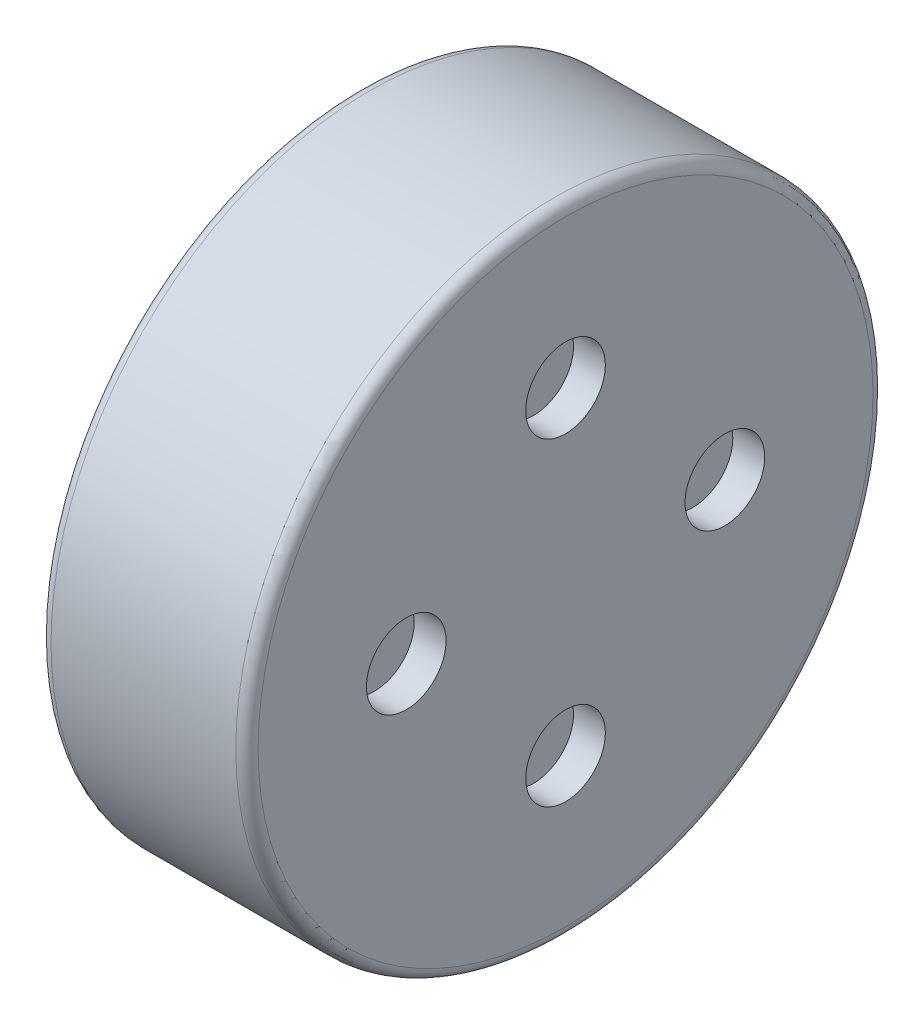
ISO-10303-21;
HEADER;
FILE_DESCRIPTION(('STEP AP214'),'2;1');
FILE_NAME('part.step','',(''),(''),'','','');
FILE_SCHEMA(('AUTOMOTIVE_DESIGN { 1 0 10303 214 1 1 1 1 }'));
ENDSEC;
DATA;
#1=APPLICATION_CONTEXT('core data for automotive mechanical design processes');
#2=APPLICATION_PROTOCOL_DEFINITION('international standard','automotive_design',2000,#1);
#3=PRODUCT_CONTEXT('',#1,'mechanical');
#4=PRODUCT('Part','Part','',(#3));
#5=PRODUCT_RELATED_PRODUCT_CATEGORY('part','',(#4));
#6=PRODUCT_DEFINITION_FORMATION('','',#4);
#7=PRODUCT_DEFINITION_CONTEXT('part definition',#1,'design');
#8=PRODUCT_DEFINITION('design','',#6,#7);
#9=PRODUCT_DEFINITION_SHAPE('','',#8);
#10=(LENGTH_UNIT() NAMED_UNIT(*) SI_UNIT(.MILLI.,.METRE.));
#11=(NAMED_UNIT(*) PLANE_ANGLE_UNIT() SI_UNIT($,.RADIAN.));
#12=(NAMED_UNIT(*) SI_UNIT($,.STERADIAN.) SOLID_ANGLE_UNIT());
#13=UNCERTAINTY_MEASURE_WITH_UNIT(LENGTH_MEASURE(1.E-05),#10,'distance_accuracy_value','');
#14=(GEOMETRIC_REPRESENTATION_CONTEXT(3) GLOBAL_UNCERTAINTY_ASSIGNED_CONTEXT((#13)) GLOBAL_UNIT_ASSIGNED_CONTEXT((#10,
#11,#12)) REPRESENTATION_CONTEXT('',''));
#15=CARTESIAN_POINT('',(0.,0.,0.));
#16=DIRECTION('',(0.,0.,1.));
#17=DIRECTION('',(1.,0.,0.));
#18=AXIS2_PLACEMENT_3D('',#15,#16,#17);
#19=CARTESIAN_POINT('',(1.3,0.,0.));
#20=DIRECTION('',(-1.,0.,0.));
#21=DIRECTION('',(0.,0.,1.));
#22=AXIS2_PLACEMENT_3D('',#19,#20,#21);
#23=CYLINDRICAL_SURFACE('',#22,2.);
#24=CARTESIAN_POINT('',(0.07,0.,0.));
#25=DIRECTION('',(-1.,0.,0.));
#26=DIRECTION('',(0.,0.,1.));
#27=AXIS2_PLACEMENT_3D('',#24,#25,#26);
#28=CIRCLE('',#27,2.);
#29=CARTESIAN_POINT('',(0.07,0.,2.));
#30=VERTEX_POINT('',#29);
#31=EDGE_CURVE('E60',#30,#30,#28,.F.);
#32=ORIENTED_EDGE('',*,*,#31,.T.);
#33=EDGE_LOOP('',(#32));
#34=FACE_BOUND('',#33,.T.);
#35=CARTESIAN_POINT('',(1.23,0.,0.));
#36=DIRECTION('',(1.,0.,0.));
#37=DIRECTION('',(0.,0.,-1.));
#38=AXIS2_PLACEMENT_3D('',#35,#36,#37);
#39=CIRCLE('',#38,2.);
#40=CARTESIAN_POINT('',(1.23,0.,-2.));
#41=VERTEX_POINT('',#40);
#42=EDGE_CURVE('E63',#41,#41,#39,.F.);
#43=ORIENTED_EDGE('',*,*,#42,.T.);
#44=EDGE_LOOP('',(#43));
#45=FACE_BOUND('',#44,.T.);
#46=ADVANCED_FACE('F31',(#34,#45),#23,.T.);
#47=CARTESIAN_POINT('',(1.3,2.,0.));
#48=DIRECTION('',(1.,0.,0.));
#49=DIRECTION('',(0.,0.,-1.));
#50=AXIS2_PLACEMENT_3D('',#47,#48,#49);
#51=PLANE('',#50);
#52=CARTESIAN_POINT('',(1.3,0.,0.));
#53=DIRECTION('',(1.,0.,0.));
#54=DIRECTION('',(0.,0.,-1.));
#55=AXIS2_PLACEMENT_3D('',#52,#53,#54);
#56=CIRCLE('',#55,1.93);
#57=CARTESIAN_POINT('',(1.3,0.,-1.93));
#58=VERTEX_POINT('',#57);
#59=EDGE_CURVE('E57',#58,#58,#56,.T.);
#60=ORIENTED_EDGE('',*,*,#59,.T.);
#61=EDGE_LOOP('',(#60));
#62=FACE_BOUND('',#61,.T.);
#63=CARTESIAN_POINT('',(1.3,0.,1.));
#64=DIRECTION('',(1.,0.,0.));
#65=DIRECTION('',(0.,0.,-1.));
#66=AXIS2_PLACEMENT_3D('',#63,#64,#65);
#67=CIRCLE('',#66,0.250000000000014);
#68=CARTESIAN_POINT('',(1.3,0.,0.749999999999986));
#69=VERTEX_POINT('',#68);
#70=EDGE_CURVE('E147',#69,#69,#67,.T.);
#71=ORIENTED_EDGE('',*,*,#70,.F.);
#72=EDGE_LOOP('',(#71));
#73=FACE_BOUND('',#72,.T.);
#74=CARTESIAN_POINT('',(1.3,-1.,0.));
#75=DIRECTION('',(1.,0.,0.));
#76=DIRECTION('',(0.,0.,-1.));
#77=AXIS2_PLACEMENT_3D('',#74,#75,#76);
#78=CIRCLE('',#77,0.250000000000014);
#79=CARTESIAN_POINT('',(1.3,-1.,-0.250000000000014));
#80=VERTEX_POINT('',#79);
#81=EDGE_CURVE('E141',#80,#80,#78,.T.);
#82=ORIENTED_EDGE('',*,*,#81,.F.);
#83=EDGE_LOOP('',(#82));
#84=FACE_BOUND('',#83,.T.);
#85=CARTESIAN_POINT('',(1.3,0.,-1.));
#86=DIRECTION('',(1.,0.,0.));
#87=DIRECTION('',(0.,0.,-1.));
#88=AXIS2_PLACEMENT_3D('',#85,#86,#87);
#89=CIRCLE('',#88,0.250000000000014);
#90=CARTESIAN_POINT('',(1.3,0.,-1.25000000000001));
#91=VERTEX_POINT('',#90);
#92=EDGE_CURVE('E135',#91,#91,#89,.T.);
#93=ORIENTED_EDGE('',*,*,#92,.F.);
#94=EDGE_LOOP('',(#93));
#95=FACE_BOUND('',#94,.T.);
#96=CARTESIAN_POINT('',(1.3,1.,0.));
#97=DIRECTION('',(1.,0.,0.));
#98=DIRECTION('',(0.,0.,-1.));
#99=AXIS2_PLACEMENT_3D('',#96,#97,#98);
#100=CIRCLE('',#99,0.250000000000014);
#101=CARTESIAN_POINT('',(1.3,1.,-0.250000000000014));
#102=VERTEX_POINT('',#101);
#103=EDGE_CURVE('E129',#102,#102,#100,.T.);
#104=ORIENTED_EDGE('',*,*,#103,.F.);
#105=EDGE_LOOP('',(#104));
#106=FACE_BOUND('',#105,.T.);
#107=ADVANCED_FACE('F153',(#62,#73,#84,#95,#106),#51,.T.);
#108=CARTESIAN_POINT('',(0.03,0.,0.));
#109=DIRECTION('',(-1.,0.,0.));
#110=DIRECTION('',(0.,0.,1.));
#111=AXIS2_PLACEMENT_3D('',#108,#109,#110);
#112=PLANE('',#111);
#113=CARTESIAN_POINT('',(0.03,-1.093714993739,-0.3553695435312));
#114=DIRECTION('',(-1.,0.,0.));
#115=DIRECTION('',(0.,0.,1.));
#116=AXIS2_PLACEMENT_3D('',#113,#114,#115);
#117=CIRCLE('',#116,0.1999999999996);
#118=CARTESIAN_POINT('',(0.03,-1.093714993739,-0.1553695435316));
#119=VERTEX_POINT('',#118);
#120=EDGE_CURVE('E87',#119,#119,#117,.T.);
#121=ORIENTED_EDGE('',*,*,#120,.F.);
#122=EDGE_LOOP('',(#121));
#123=FACE_BOUND('',#122,.T.);
#124=CARTESIAN_POINT('',(0.03,-0.6759530401363,0.9303695435312));
#125=DIRECTION('',(-1.,0.,0.));
#126=DIRECTION('',(0.,0.,1.));
#127=AXIS2_PLACEMENT_3D('',#124,#125,#126);
#128=CIRCLE('',#127,0.2);
#129=CARTESIAN_POINT('',(0.03,-0.6759530401363,1.1303695435312));
#130=VERTEX_POINT('',#129);
#131=EDGE_CURVE('E90',#130,#130,#128,.T.);
#132=ORIENTED_EDGE('',*,*,#131,.F.);
#133=EDGE_LOOP('',(#132));
#134=FACE_BOUND('',#133,.T.);
#135=CARTESIAN_POINT('',(0.03,0.6759530401363,0.9303695435312));
#136=DIRECTION('',(-1.,0.,0.));
#137=DIRECTION('',(0.,0.,1.));
#138=AXIS2_PLACEMENT_3D('',#135,#136,#137);
#139=CIRCLE('',#138,0.2);
#140=CARTESIAN_POINT('',(0.03,0.6759530401363,1.1303695435312));
#141=VERTEX_POINT('',#140);
#142=EDGE_CURVE('E93',#141,#141,#139,.T.);
#143=ORIENTED_EDGE('',*,*,#142,.F.);
#144=EDGE_LOOP('',(#143));
#145=FACE_BOUND('',#144,.T.);
#146=CARTESIAN_POINT('',(0.03,1.093714993739,-0.3553695435312));
#147=DIRECTION('',(-1.,0.,0.));
#148=DIRECTION('',(0.,0.,1.));
#149=AXIS2_PLACEMENT_3D('',#146,#147,#148);
#150=CIRCLE('',#149,0.2);
#151=CARTESIAN_POINT('',(0.03,1.093714993739,-0.1553695435312));
#152=VERTEX_POINT('',#151);
#153=EDGE_CURVE('E96',#152,#152,#150,.T.);
#154=ORIENTED_EDGE('',*,*,#153,.F.);
#155=EDGE_LOOP('',(#154));
#156=FACE_BOUND('',#155,.T.);
#157=CARTESIAN_POINT('',(0.03,0.,-1.15));
#158=DIRECTION('',(-1.,0.,0.));
#159=DIRECTION('',(0.,0.,1.));
#160=AXIS2_PLACEMENT_3D('',#157,#158,#159);
#161=CIRCLE('',#160,0.2);
#162=CARTESIAN_POINT('',(0.03,0.,-0.95));
#163=VERTEX_POINT('',#162);
#164=EDGE_CURVE('E99',#163,#163,#161,.T.);
#165=ORIENTED_EDGE('',*,*,#164,.F.);
#166=EDGE_LOOP('',(#165));
#167=FACE_BOUND('',#166,.T.);
#168=CARTESIAN_POINT('',(0.03,0.,0.));
#169=DIRECTION('',(-1.,0.,0.));
#170=DIRECTION('',(0.,0.,-1.));
#171=AXIS2_PLACEMENT_3D('',#168,#169,#170);
#172=CIRCLE('',#171,0.9);
#173=CARTESIAN_POINT('',(0.03,0.,-0.9));
#174=VERTEX_POINT('',#173);
#175=EDGE_CURVE('E116',#174,#174,#172,.T.);
#176=ORIENTED_EDGE('',*,*,#175,.F.);
#177=EDGE_LOOP('',(#176));
#178=FACE_BOUND('',#177,.T.);
#179=CARTESIAN_POINT('',(0.0300000000000001,0.,0.));
#180=DIRECTION('',(-1.,0.,0.));
#181=DIRECTION('',(0.,0.,1.));
#182=AXIS2_PLACEMENT_3D('',#179,#180,#181);
#183=CIRCLE('',#182,1.8);
#184=CARTESIAN_POINT('',(0.0300000000000001,0.,1.8));
#185=VERTEX_POINT('',#184);
#186=EDGE_CURVE('E106',#185,#185,#183,.T.);
#187=ORIENTED_EDGE('',*,*,#186,.T.);
#188=EDGE_LOOP('',(#187));
#189=FACE_BOUND('',#188,.T.);
#190=ADVANCED_FACE('F156',(#123,#134,#145,#156,#167,#178,#189),#112,.T.);
#191=CARTESIAN_POINT('',(1.3,0.,0.));
#192=DIRECTION('',(-1.,0.,0.));
#193=DIRECTION('',(0.,0.,1.));
#194=AXIS2_PLACEMENT_3D('',#191,#192,#193);
#195=CYLINDRICAL_SURFACE('',#194,1.8);
#196=CARTESIAN_POINT('',(0.049999999999999,0.,0.));
#197=DIRECTION('',(-1.,0.,0.));
#198=DIRECTION('',(0.,0.,1.));
#199=AXIS2_PLACEMENT_3D('',#196,#197,#198);
#200=CIRCLE('',#199,1.8);
#201=CARTESIAN_POINT('',(0.049999999999999,0.,1.8));
#202=VERTEX_POINT('',#201);
#203=EDGE_CURVE('E109',#202,#202,#200,.T.);
#204=ORIENTED_EDGE('',*,*,#203,.T.);
#205=EDGE_LOOP('',(#204));
#206=FACE_BOUND('',#205,.T.);
#207=ORIENTED_EDGE('',*,*,#186,.F.);
#208=EDGE_LOOP('',(#207));
#209=FACE_BOUND('',#208,.T.);
#210=ADVANCED_FACE('F294',(#206,#209),#195,.T.);
#211=CARTESIAN_POINT('',(0.0499999999999991,0.,0.));
#212=DIRECTION('',(-1.,0.,0.));
#213=DIRECTION('',(0.,0.,1.));
#214=AXIS2_PLACEMENT_3D('',#211,#212,#213);
#215=TOROIDAL_SURFACE('',#214,1.85,0.0499999999999993);
#216=CARTESIAN_POINT('',(0.,0.,0.));
#217=DIRECTION('',(-1.,0.,0.));
#218=DIRECTION('',(0.,0.,1.));
#219=AXIS2_PLACEMENT_3D('',#216,#217,#218);
#220=CIRCLE('',#219,1.85);
#221=CARTESIAN_POINT('',(0.,0.,1.85));
#222=VERTEX_POINT('',#221);
#223=EDGE_CURVE('E112',#222,#222,#220,.T.);
#224=ORIENTED_EDGE('',*,*,#223,.T.);
#225=EDGE_LOOP('',(#224));
#226=FACE_BOUND('',#225,.T.);
#227=ORIENTED_EDGE('',*,*,#203,.F.);
#228=EDGE_LOOP('',(#227));
#229=FACE_BOUND('',#228,.T.);
#230=ADVANCED_FACE('F290',(#226,#229),#215,.T.);
#231=CARTESIAN_POINT('',(0.,1.85,0.));
#232=DIRECTION('',(-1.,0.,0.));
#233=DIRECTION('',(0.,0.,1.));
#234=AXIS2_PLACEMENT_3D('',#231,#232,#233);
#235=PLANE('',#234);
#236=CARTESIAN_POINT('',(0.,0.,0.));
#237=DIRECTION('',(-1.,0.,0.));
#238=DIRECTION('',(0.,0.,1.));
#239=AXIS2_PLACEMENT_3D('',#236,#237,#238);
#240=CIRCLE('',#239,1.93);
#241=CARTESIAN_POINT('',(0.,0.,1.93));
#242=VERTEX_POINT('',#241);
#243=EDGE_CURVE('E66',#242,#242,#240,.T.);
#244=ORIENTED_EDGE('',*,*,#243,.T.);
#245=EDGE_LOOP('',(#244));
#246=FACE_BOUND('',#245,.T.);
#247=ORIENTED_EDGE('',*,*,#223,.F.);
#248=EDGE_LOOP('',(#247));
#249=FACE_BOUND('',#248,.T.);
#250=ADVANCED_FACE('F286',(#246,#249),#235,.T.);
#251=CARTESIAN_POINT('',(0.08,0.,0.));
#252=DIRECTION('',(-1.,0.,0.));
#253=DIRECTION('',(0.,0.,1.));
#254=AXIS2_PLACEMENT_3D('',#251,#252,#253);
#255=CYLINDRICAL_SURFACE('',#254,0.9);
#256=CARTESIAN_POINT('',(0.08,0.,0.));
#257=DIRECTION('',(-1.,0.,0.));
#258=DIRECTION('',(0.,0.,-1.));
#259=AXIS2_PLACEMENT_3D('',#256,#257,#258);
#260=CIRCLE('',#259,0.9);
#261=CARTESIAN_POINT('',(0.08,0.,-0.9));
#262=VERTEX_POINT('',#261);
#263=EDGE_CURVE('E115',#262,#262,#260,.T.);
#264=ORIENTED_EDGE('',*,*,#263,.F.);
#265=EDGE_LOOP('',(#264));
#266=FACE_BOUND('',#265,.T.);
#267=ORIENTED_EDGE('',*,*,#175,.T.);
#268=EDGE_LOOP('',(#267));
#269=FACE_BOUND('',#268,.T.);
#270=ADVANCED_FACE('F282',(#266,#269),#255,.F.);
#271=CARTESIAN_POINT('',(0.08,0.,0.));
#272=DIRECTION('',(1.,0.,0.));
#273=DIRECTION('',(0.,0.,-1.));
#274=AXIS2_PLACEMENT_3D('',#271,#272,#273);
#275=PLANE('',#274);
#276=CARTESIAN_POINT('',(0.08,0.,0.));
#277=DIRECTION('',(1.,0.,0.));
#278=DIRECTION('',(0.,0.,-1.));
#279=AXIS2_PLACEMENT_3D('',#276,#277,#278);
#280=CIRCLE('',#279,0.6);
#281=CARTESIAN_POINT('',(0.08,0.,-0.6));
#282=VERTEX_POINT('',#281);
#283=EDGE_CURVE('E103',#282,#282,#280,.F.);
#284=ORIENTED_EDGE('',*,*,#283,.F.);
#285=EDGE_LOOP('',(#284));
#286=FACE_BOUND('',#285,.T.);
#287=ORIENTED_EDGE('',*,*,#263,.T.);
#288=EDGE_LOOP('',(#287));
#289=FACE_BOUND('',#288,.T.);
#290=ADVANCED_FACE('F278',(#286,#289),#275,.F.);
#291=CARTESIAN_POINT('',(0.03,0.,0.));
#292=DIRECTION('',(1.,0.,0.));
#293=DIRECTION('',(0.,0.,-1.));
#294=AXIS2_PLACEMENT_3D('',#291,#292,#293);
#295=CYLINDRICAL_SURFACE('',#294,0.6);
#296=CARTESIAN_POINT('',(0.03,0.,0.));
#297=DIRECTION('',(-1.,0.,0.));
#298=DIRECTION('',(0.,0.,1.));
#299=AXIS2_PLACEMENT_3D('',#296,#297,#298);
#300=CIRCLE('',#299,0.6);
#301=CARTESIAN_POINT('',(0.03,0.,0.6));
#302=VERTEX_POINT('',#301);
#303=EDGE_CURVE('E119',#302,#302,#300,.T.);
#304=ORIENTED_EDGE('',*,*,#303,.F.);
#305=EDGE_LOOP('',(#304));
#306=FACE_BOUND('',#305,.T.);
#307=ORIENTED_EDGE('',*,*,#283,.T.);
#308=EDGE_LOOP('',(#307));
#309=FACE_BOUND('',#308,.T.);
#310=ADVANCED_FACE('F274',(#306,#309),#295,.T.);
#311=CARTESIAN_POINT('',(0.03,0.,0.));
#312=DIRECTION('',(-1.,0.,0.));
#313=DIRECTION('',(0.,0.,1.));
#314=AXIS2_PLACEMENT_3D('',#311,#312,#313);
#315=PLANE('',#314);
#316=CARTESIAN_POINT('',(0.03,0.,0.));
#317=DIRECTION('',(-1.,0.,0.));
#318=DIRECTION('',(0.,0.,1.));
#319=AXIS2_PLACEMENT_3D('',#316,#317,#318);
#320=CIRCLE('',#319,0.275);
#321=CARTESIAN_POINT('',(0.03,0.,0.275));
#322=VERTEX_POINT('',#321);
#323=EDGE_CURVE('E102',#322,#322,#320,.T.);
#324=ORIENTED_EDGE('',*,*,#323,.F.);
#325=EDGE_LOOP('',(#324));
#326=FACE_BOUND('',#325,.T.);
#327=ORIENTED_EDGE('',*,*,#303,.T.);
#328=EDGE_LOOP('',(#327));
#329=FACE_BOUND('',#328,.T.);
#330=ADVANCED_FACE('F270',(#326,#329),#315,.T.);
#331=CARTESIAN_POINT('',(-0.05,0.,0.));
#332=DIRECTION('',(1.,0.,0.));
#333=DIRECTION('',(0.,0.,-1.));
#334=AXIS2_PLACEMENT_3D('',#331,#332,#333);
#335=CYLINDRICAL_SURFACE('',#334,0.275);
#336=CARTESIAN_POINT('',(0.0200000000000001,0.,0.));
#337=DIRECTION('',(-1.,0.,0.));
#338=DIRECTION('',(0.,0.,1.));
#339=AXIS2_PLACEMENT_3D('',#336,#337,#338);
#340=CIRCLE('',#339,0.275);
#341=CARTESIAN_POINT('',(0.0200000000000001,0.,0.275));
#342=VERTEX_POINT('',#341);
#343=EDGE_CURVE('E51',#342,#342,#340,.F.);
#344=ORIENTED_EDGE('',*,*,#343,.T.);
#345=EDGE_LOOP('',(#344));
#346=FACE_BOUND('',#345,.T.);
#347=ORIENTED_EDGE('',*,*,#323,.T.);
#348=EDGE_LOOP('',(#347));
#349=FACE_BOUND('',#348,.T.);
#350=ADVANCED_FACE('F266',(#346,#349),#335,.T.);
#351=CARTESIAN_POINT('',(-0.05,0.,0.));
#352=DIRECTION('',(-1.,0.,0.));
#353=DIRECTION('',(0.,0.,1.));
#354=AXIS2_PLACEMENT_3D('',#351,#352,#353);
#355=PLANE('',#354);
#356=CARTESIAN_POINT('',(-0.05,0.,0.));
#357=DIRECTION('',(-1.,0.,0.));
#358=DIRECTION('',(0.,0.,1.));
#359=AXIS2_PLACEMENT_3D('',#356,#357,#358);
#360=CIRCLE('',#359,0.205);
#361=CARTESIAN_POINT('',(-0.05,0.,0.205));
#362=VERTEX_POINT('',#361);
#363=EDGE_CURVE('E54',#362,#362,#360,.T.);
#364=ORIENTED_EDGE('',*,*,#363,.T.);
#365=EDGE_LOOP('',(#364));
#366=FACE_BOUND('',#365,.T.);
#367=ADVANCED_FACE('F262',(#366),#355,.T.);
#368=CARTESIAN_POINT('',(0.03,0.,-1.15));
#369=DIRECTION('',(-1.,0.,0.));
#370=DIRECTION('',(0.,0.,1.));
#371=AXIS2_PLACEMENT_3D('',#368,#369,#370);
#372=CYLINDRICAL_SURFACE('',#371,0.2);
#373=CARTESIAN_POINT('',(0.02,0.,-1.15));
#374=DIRECTION('',(-1.,0.,0.));
#375=DIRECTION('',(0.,0.,1.));
#376=AXIS2_PLACEMENT_3D('',#373,#374,#375);
#377=CIRCLE('',#376,0.2);
#378=CARTESIAN_POINT('',(0.02,0.,-0.95));
#379=VERTEX_POINT('',#378);
#380=EDGE_CURVE('E81',#379,#379,#377,.F.);
#381=ORIENTED_EDGE('',*,*,#380,.T.);
#382=EDGE_LOOP('',(#381));
#383=FACE_BOUND('',#382,.T.);
#384=ORIENTED_EDGE('',*,*,#164,.T.);
#385=EDGE_LOOP('',(#384));
#386=FACE_BOUND('',#385,.T.);
#387=ADVANCED_FACE('F258',(#383,#386),#372,.T.);
#388=CARTESIAN_POINT('',(-0.05,0.,-1.15));
#389=DIRECTION('',(-1.,0.,0.));
#390=DIRECTION('',(0.,0.,1.));
#391=AXIS2_PLACEMENT_3D('',#388,#389,#390);
#392=PLANE('',#391);
#393=CARTESIAN_POINT('',(-0.05,0.,-1.15));
#394=DIRECTION('',(-1.,0.,0.));
#395=DIRECTION('',(0.,0.,1.));
#396=AXIS2_PLACEMENT_3D('',#393,#394,#395);
#397=CIRCLE('',#396,0.13);
#398=CARTESIAN_POINT('',(-0.05,0.,-1.02));
#399=VERTEX_POINT('',#398);
#400=EDGE_CURVE('E84',#399,#399,#397,.T.);
#401=ORIENTED_EDGE('',*,*,#400,.T.);
#402=EDGE_LOOP('',(#401));
#403=FACE_BOUND('',#402,.T.);
#404=ADVANCED_FACE('F254',(#403),#392,.T.);
#405=CARTESIAN_POINT('',(0.03,1.093714993739,-0.3553695435312));
#406=DIRECTION('',(-1.,0.,0.));
#407=DIRECTION('',(0.,-1.,0.));
#408=AXIS2_PLACEMENT_3D('',#405,#406,#407);
#409=CYLINDRICAL_SURFACE('',#408,0.2);
#410=CARTESIAN_POINT('',(0.0200000000000003,1.093714993739,-0.3553695435312));
#411=DIRECTION('',(-1.,0.,0.));
#412=DIRECTION('',(0.,-1.,0.));
#413=AXIS2_PLACEMENT_3D('',#410,#411,#412);
#414=CIRCLE('',#413,0.2);
#415=CARTESIAN_POINT('',(0.0200000000000008,0.893714993739,-0.3553695435312));
#416=VERTEX_POINT('',#415);
#417=EDGE_CURVE('E75',#416,#416,#414,.F.);
#418=ORIENTED_EDGE('',*,*,#417,.T.);
#419=EDGE_LOOP('',(#418));
#420=FACE_BOUND('',#419,.T.);
#421=ORIENTED_EDGE('',*,*,#153,.T.);
#422=EDGE_LOOP('',(#421));
#423=FACE_BOUND('',#422,.T.);
#424=ADVANCED_FACE('F250',(#420,#423),#409,.T.);
#425=CARTESIAN_POINT('',(-0.0499999999999997,1.093714993739,-0.3553695435312));
#426=DIRECTION('',(-1.,0.,0.));
#427=DIRECTION('',(0.,-1.,0.));
#428=AXIS2_PLACEMENT_3D('',#425,#426,#427);
#429=PLANE('',#428);
#430=CARTESIAN_POINT('',(-0.0499999999999997,1.093714993739,-0.3553695435312));
#431=DIRECTION('',(-1.,0.,0.));
#432=DIRECTION('',(0.,-1.,0.));
#433=AXIS2_PLACEMENT_3D('',#430,#431,#432);
#434=CIRCLE('',#433,0.13);
#435=CARTESIAN_POINT('',(-0.0499999999999994,0.963714993739,-0.3553695435312));
#436=VERTEX_POINT('',#435);
#437=EDGE_CURVE('E78',#436,#436,#434,.T.);
#438=ORIENTED_EDGE('',*,*,#437,.T.);
#439=EDGE_LOOP('',(#438));
#440=FACE_BOUND('',#439,.T.);
#441=ADVANCED_FACE('F246',(#440),#429,.T.);
#442=CARTESIAN_POINT('',(0.03,0.6759530401363,0.9303695435312));
#443=DIRECTION('',(-1.,0.,0.));
#444=DIRECTION('',(0.,0.,1.));
#445=AXIS2_PLACEMENT_3D('',#442,#443,#444);
#446=CYLINDRICAL_SURFACE('',#445,0.2);
#447=CARTESIAN_POINT('',(0.02,0.6759530401363,0.9303695435312));
#448=DIRECTION('',(-1.,0.,0.));
#449=DIRECTION('',(0.,0.,1.));
#450=AXIS2_PLACEMENT_3D('',#447,#448,#449);
#451=CIRCLE('',#450,0.2);
#452=CARTESIAN_POINT('',(0.02,0.6759530401363,1.1303695435312));
#453=VERTEX_POINT('',#452);
#454=EDGE_CURVE('E69',#453,#453,#451,.F.);
#455=ORIENTED_EDGE('',*,*,#454,.T.);
#456=EDGE_LOOP('',(#455));
#457=FACE_BOUND('',#456,.T.);
#458=ORIENTED_EDGE('',*,*,#142,.T.);
#459=EDGE_LOOP('',(#458));
#460=FACE_BOUND('',#459,.T.);
#461=ADVANCED_FACE('F242',(#457,#460),#446,.T.);
#462=CARTESIAN_POINT('',(-0.05,0.6759530401363,0.9303695435312));
#463=DIRECTION('',(-1.,0.,0.));
#464=DIRECTION('',(0.,0.,1.));
#465=AXIS2_PLACEMENT_3D('',#462,#463,#464);
#466=PLANE('',#465);
#467=CARTESIAN_POINT('',(-0.05,0.6759530401363,0.9303695435312));
#468=DIRECTION('',(-1.,0.,0.));
#469=DIRECTION('',(0.,0.,1.));
#470=AXIS2_PLACEMENT_3D('',#467,#468,#469);
#471=CIRCLE('',#470,0.13);
#472=CARTESIAN_POINT('',(-0.05,0.6759530401363,1.0603695435312));
#473=VERTEX_POINT('',#472);
#474=EDGE_CURVE('E72',#473,#473,#471,.T.);
#475=ORIENTED_EDGE('',*,*,#474,.T.);
#476=EDGE_LOOP('',(#475));
#477=FACE_BOUND('',#476,.T.);
#478=ADVANCED_FACE('F239',(#477),#466,.T.);
#479=CARTESIAN_POINT('',(0.03,-0.6759530401363,0.9303695435312));
#480=DIRECTION('',(-1.,0.,0.));
#481=DIRECTION('',(0.,-1.,0.));
#482=AXIS2_PLACEMENT_3D('',#479,#480,#481);
#483=CYLINDRICAL_SURFACE('',#482,0.2);
#484=CARTESIAN_POINT('',(0.0200000000000003,-0.6759530401363,0.9303695435312));
#485=DIRECTION('',(-1.,0.,0.));
#486=DIRECTION('',(0.,-1.,0.));
#487=AXIS2_PLACEMENT_3D('',#484,#485,#486);
#488=CIRCLE('',#487,0.2);
#489=CARTESIAN_POINT('',(0.0200000000000008,-0.8759530401363,0.9303695435312));
#490=VERTEX_POINT('',#489);
#491=EDGE_CURVE('E10',#490,#490,#488,.F.);
#492=ORIENTED_EDGE('',*,*,#491,.T.);
#493=EDGE_LOOP('',(#492));
#494=FACE_BOUND('',#493,.T.);
#495=ORIENTED_EDGE('',*,*,#131,.T.);
#496=EDGE_LOOP('',(#495));
#497=FACE_BOUND('',#496,.T.);
#498=ADVANCED_FACE('F236',(#494,#497),#483,.T.);
#499=CARTESIAN_POINT('',(-0.0499999999999997,-0.6759530401363,0.9303695435312));
#500=DIRECTION('',(-1.,0.,0.));
#501=DIRECTION('',(0.,-1.,0.));
#502=AXIS2_PLACEMENT_3D('',#499,#500,#501);
#503=PLANE('',#502);
#504=CARTESIAN_POINT('',(-0.0499999999999997,-0.6759530401363,0.9303695435312));
#505=DIRECTION('',(-1.,0.,0.));
#506=DIRECTION('',(0.,-1.,0.));
#507=AXIS2_PLACEMENT_3D('',#504,#505,#506);
#508=CIRCLE('',#507,0.13);
#509=CARTESIAN_POINT('',(-0.0499999999999994,-0.8059530401363,0.9303695435312));
#510=VERTEX_POINT('',#509);
#511=EDGE_CURVE('E38',#510,#510,#508,.T.);
#512=ORIENTED_EDGE('',*,*,#511,.T.);
#513=EDGE_LOOP('',(#512));
#514=FACE_BOUND('',#513,.T.);
#515=ADVANCED_FACE('F230',(#514),#503,.T.);
#516=CARTESIAN_POINT('',(0.03,-1.093714993739,-0.3553695435312));
#517=DIRECTION('',(-1.,0.,0.));
#518=DIRECTION('',(0.,-1.,0.));
#519=AXIS2_PLACEMENT_3D('',#516,#517,#518);
#520=CYLINDRICAL_SURFACE('',#519,0.1999999999996);
#521=CARTESIAN_POINT('',(0.0199999999999998,-1.093714993739,-0.3553695435312));
#522=DIRECTION('',(-1.,0.,0.));
#523=DIRECTION('',(0.,-1.,0.));
#524=AXIS2_PLACEMENT_3D('',#521,#522,#523);
#525=CIRCLE('',#524,0.1999999999996);
#526=CARTESIAN_POINT('',(0.0199999999999992,-1.2937149937386,-0.3553695435312));
#527=VERTEX_POINT('',#526);
#528=EDGE_CURVE('E42',#527,#527,#525,.F.);
#529=ORIENTED_EDGE('',*,*,#528,.T.);
#530=EDGE_LOOP('',(#529));
#531=FACE_BOUND('',#530,.T.);
#532=ORIENTED_EDGE('',*,*,#120,.T.);
#533=EDGE_LOOP('',(#532));
#534=FACE_BOUND('',#533,.T.);
#535=ADVANCED_FACE('F225',(#531,#534),#520,.T.);
#536=CARTESIAN_POINT('',(-0.0500000000000003,-1.093714993739,-0.3553695435312));
#537=DIRECTION('',(-1.,0.,0.));
#538=DIRECTION('',(0.,-1.,0.));
#539=AXIS2_PLACEMENT_3D('',#536,#537,#538);
#540=PLANE('',#539);
#541=CARTESIAN_POINT('',(-0.0500000000000003,-1.093714993739,-0.3553695435312));
#542=DIRECTION('',(-1.,0.,0.));
#543=DIRECTION('',(0.,-1.,0.));
#544=AXIS2_PLACEMENT_3D('',#541,#542,#543);
#545=CIRCLE('',#544,0.1299999999996);
#546=CARTESIAN_POINT('',(-0.0500000000000006,-1.2237149937386,-0.3553695435312));
#547=VERTEX_POINT('',#546);
#548=EDGE_CURVE('E46',#547,#547,#545,.T.);
#549=ORIENTED_EDGE('',*,*,#548,.T.);
#550=EDGE_LOOP('',(#549));
#551=FACE_BOUND('',#550,.T.);
#552=ADVANCED_FACE('F178',(#551),#540,.T.);
#553=CARTESIAN_POINT('',(1.10000000000015,1.,0.));
#554=DIRECTION('',(-1.,0.,0.));
#555=DIRECTION('',(0.,0.,1.));
#556=AXIS2_PLACEMENT_3D('',#553,#554,#555);
#557=PLANE('',#556);
#558=CARTESIAN_POINT('',(1.10000000000015,1.,0.));
#559=DIRECTION('',(1.,0.,0.));
#560=DIRECTION('',(0.,0.,-1.));
#561=AXIS2_PLACEMENT_3D('',#558,#559,#560);
#562=CIRCLE('',#561,0.250000000000014);
#563=CARTESIAN_POINT('',(1.10000000000015,1.,-0.250000000000014));
#564=VERTEX_POINT('',#563);
#565=EDGE_CURVE('E124',#564,#564,#562,.T.);
#566=ORIENTED_EDGE('',*,*,#565,.T.);
#567=EDGE_LOOP('',(#566));
#568=FACE_BOUND('',#567,.T.);
#569=ADVANCED_FACE('F168',(#568),#557,.F.);
#570=CARTESIAN_POINT('',(1.3,1.,0.));
#571=DIRECTION('',(1.,0.,0.));
#572=DIRECTION('',(0.,0.,-1.));
#573=AXIS2_PLACEMENT_3D('',#570,#571,#572);
#574=CYLINDRICAL_SURFACE('',#573,0.250000000000014);
#575=ORIENTED_EDGE('',*,*,#565,.F.);
#576=EDGE_LOOP('',(#575));
#577=FACE_BOUND('',#576,.T.);
#578=ORIENTED_EDGE('',*,*,#103,.T.);
#579=EDGE_LOOP('',(#578));
#580=FACE_BOUND('',#579,.T.);
#581=ADVANCED_FACE('F165',(#577,#580),#574,.F.);
#582=CARTESIAN_POINT('',(1.10000000000015,0.,-1.));
#583=DIRECTION('',(-1.,0.,0.));
#584=DIRECTION('',(0.,0.,1.));
#585=AXIS2_PLACEMENT_3D('',#582,#583,#584);
#586=PLANE('',#585);
#587=CARTESIAN_POINT('',(1.10000000000015,0.,-1.));
#588=DIRECTION('',(1.,0.,0.));
#589=DIRECTION('',(0.,0.,-1.));
#590=AXIS2_PLACEMENT_3D('',#587,#588,#589);
#591=CIRCLE('',#590,0.250000000000014);
#592=CARTESIAN_POINT('',(1.10000000000015,0.,-1.25000000000001));
#593=VERTEX_POINT('',#592);
#594=EDGE_CURVE('E132',#593,#593,#591,.T.);
#595=ORIENTED_EDGE('',*,*,#594,.T.);
#596=EDGE_LOOP('',(#595));
#597=FACE_BOUND('',#596,.T.);
#598=ADVANCED_FACE('F167',(#597),#586,.F.);
#599=CARTESIAN_POINT('',(1.3,0.,-1.));
#600=DIRECTION('',(1.,0.,0.));
#601=DIRECTION('',(0.,0.,-1.));
#602=AXIS2_PLACEMENT_3D('',#599,#600,#601);
#603=CYLINDRICAL_SURFACE('',#602,0.250000000000014);
#604=ORIENTED_EDGE('',*,*,#594,.F.);
#605=EDGE_LOOP('',(#604));
#606=FACE_BOUND('',#605,.T.);
#607=ORIENTED_EDGE('',*,*,#92,.T.);
#608=EDGE_LOOP('',(#607));
#609=FACE_BOUND('',#608,.T.);
#610=ADVANCED_FACE('F175',(#606,#609),#603,.F.);
#611=CARTESIAN_POINT('',(1.10000000000015,-1.,0.));
#612=DIRECTION('',(-1.,0.,0.));
#613=DIRECTION('',(0.,0.,1.));
#614=AXIS2_PLACEMENT_3D('',#611,#612,#613);
#615=PLANE('',#614);
#616=CARTESIAN_POINT('',(1.10000000000015,-1.,0.));
#617=DIRECTION('',(1.,0.,0.));
#618=DIRECTION('',(0.,0.,-1.));
#619=AXIS2_PLACEMENT_3D('',#616,#617,#618);
#620=CIRCLE('',#619,0.250000000000014);
#621=CARTESIAN_POINT('',(1.10000000000015,-1.,-0.250000000000014));
#622=VERTEX_POINT('',#621);
#623=EDGE_CURVE('E138',#622,#622,#620,.T.);
#624=ORIENTED_EDGE('',*,*,#623,.T.);
#625=EDGE_LOOP('',(#624));
#626=FACE_BOUND('',#625,.T.);
#627=ADVANCED_FACE('F472',(#626),#615,.F.);
#628=CARTESIAN_POINT('',(1.3,-1.,0.));
#629=DIRECTION('',(1.,0.,0.));
#630=DIRECTION('',(0.,0.,-1.));
#631=AXIS2_PLACEMENT_3D('',#628,#629,#630);
#632=CYLINDRICAL_SURFACE('',#631,0.250000000000014);
#633=ORIENTED_EDGE('',*,*,#623,.F.);
#634=EDGE_LOOP('',(#633));
#635=FACE_BOUND('',#634,.T.);
#636=ORIENTED_EDGE('',*,*,#81,.T.);
#637=EDGE_LOOP('',(#636));
#638=FACE_BOUND('',#637,.T.);
#639=ADVANCED_FACE('F464',(#635,#638),#632,.F.);
#640=CARTESIAN_POINT('',(1.10000000000015,0.,1.));
#641=DIRECTION('',(-1.,0.,0.));
#642=DIRECTION('',(0.,0.,1.));
#643=AXIS2_PLACEMENT_3D('',#640,#641,#642);
#644=PLANE('',#643);
#645=CARTESIAN_POINT('',(1.10000000000015,0.,1.));
#646=DIRECTION('',(1.,0.,0.));
#647=DIRECTION('',(0.,0.,-1.));
#648=AXIS2_PLACEMENT_3D('',#645,#646,#647);
#649=CIRCLE('',#648,0.250000000000014);
#650=CARTESIAN_POINT('',(1.10000000000015,0.,0.749999999999986));
#651=VERTEX_POINT('',#650);
#652=EDGE_CURVE('E144',#651,#651,#649,.T.);
#653=ORIENTED_EDGE('',*,*,#652,.T.);
#654=EDGE_LOOP('',(#653));
#655=FACE_BOUND('',#654,.T.);
#656=ADVANCED_FACE('F457',(#655),#644,.F.);
#657=CARTESIAN_POINT('',(1.3,0.,1.));
#658=DIRECTION('',(1.,0.,0.));
#659=DIRECTION('',(0.,0.,-1.));
#660=AXIS2_PLACEMENT_3D('',#657,#658,#659);
#661=CYLINDRICAL_SURFACE('',#660,0.250000000000014);
#662=ORIENTED_EDGE('',*,*,#652,.F.);
#663=EDGE_LOOP('',(#662));
#664=FACE_BOUND('',#663,.T.);
#665=ORIENTED_EDGE('',*,*,#70,.T.);
#666=EDGE_LOOP('',(#665));
#667=FACE_BOUND('',#666,.T.);
#668=ADVANCED_FACE('F151',(#664,#667),#661,.F.);
#669=CARTESIAN_POINT('',(0.02,0.,-1.15));
#670=DIRECTION('',(-1.,0.,0.));
#671=DIRECTION('',(0.,0.,1.));
#672=AXIS2_PLACEMENT_3D('',#669,#670,#671);
#673=TOROIDAL_SURFACE('',#672,0.13,0.07);
#674=ORIENTED_EDGE('',*,*,#380,.F.);
#675=EDGE_LOOP('',(#674));
#676=FACE_BOUND('',#675,.T.);
#677=ORIENTED_EDGE('',*,*,#400,.F.);
#678=EDGE_LOOP('',(#677));
#679=FACE_BOUND('',#678,.T.);
#680=ADVANCED_FACE('F190',(#676,#679),#673,.T.);
#681=CARTESIAN_POINT('',(0.0200000000000003,1.093714993739,-0.3553695435312));
#682=DIRECTION('',(-1.,0.,0.));
#683=DIRECTION('',(0.,-1.,0.));
#684=AXIS2_PLACEMENT_3D('',#681,#682,#683);
#685=TOROIDAL_SURFACE('',#684,0.13,0.07);
#686=ORIENTED_EDGE('',*,*,#417,.F.);
#687=EDGE_LOOP('',(#686));
#688=FACE_BOUND('',#687,.T.);
#689=ORIENTED_EDGE('',*,*,#437,.F.);
#690=EDGE_LOOP('',(#689));
#691=FACE_BOUND('',#690,.T.);
#692=ADVANCED_FACE('F193',(#688,#691),#685,.T.);
#693=CARTESIAN_POINT('',(0.02,0.6759530401363,0.9303695435312));
#694=DIRECTION('',(-1.,0.,0.));
#695=DIRECTION('',(0.,0.,1.));
#696=AXIS2_PLACEMENT_3D('',#693,#694,#695);
#697=TOROIDAL_SURFACE('',#696,0.13,0.07);
#698=ORIENTED_EDGE('',*,*,#454,.F.);
#699=EDGE_LOOP('',(#698));
#700=FACE_BOUND('',#699,.T.);
#701=ORIENTED_EDGE('',*,*,#474,.F.);
#702=EDGE_LOOP('',(#701));
#703=FACE_BOUND('',#702,.T.);
#704=ADVANCED_FACE('F197',(#700,#703),#697,.T.);
#705=CARTESIAN_POINT('',(0.07,0.,0.));
#706=DIRECTION('',(-1.,0.,0.));
#707=DIRECTION('',(0.,0.,1.));
#708=AXIS2_PLACEMENT_3D('',#705,#706,#707);
#709=TOROIDAL_SURFACE('',#708,1.93,0.07);
#710=ORIENTED_EDGE('',*,*,#31,.F.);
#711=EDGE_LOOP('',(#710));
#712=FACE_BOUND('',#711,.T.);
#713=ORIENTED_EDGE('',*,*,#243,.F.);
#714=EDGE_LOOP('',(#713));
#715=FACE_BOUND('',#714,.T.);
#716=ADVANCED_FACE('F201',(#712,#715),#709,.T.);
#717=CARTESIAN_POINT('',(1.23,0.,0.));
#718=DIRECTION('',(1.,0.,0.));
#719=DIRECTION('',(0.,0.,-1.));
#720=AXIS2_PLACEMENT_3D('',#717,#718,#719);
#721=TOROIDAL_SURFACE('',#720,1.93,0.07);
#722=ORIENTED_EDGE('',*,*,#59,.F.);
#723=EDGE_LOOP('',(#722));
#724=FACE_BOUND('',#723,.T.);
#725=ORIENTED_EDGE('',*,*,#42,.F.);
#726=EDGE_LOOP('',(#725));
#727=FACE_BOUND('',#726,.T.);
#728=ADVANCED_FACE('F205',(#724,#727),#721,.T.);
#729=CARTESIAN_POINT('',(0.0200000000000001,0.,0.));
#730=DIRECTION('',(-1.,0.,0.));
#731=DIRECTION('',(0.,0.,1.));
#732=AXIS2_PLACEMENT_3D('',#729,#730,#731);
#733=TOROIDAL_SURFACE('',#732,0.205,0.07);
#734=ORIENTED_EDGE('',*,*,#343,.F.);
#735=EDGE_LOOP('',(#734));
#736=FACE_BOUND('',#735,.T.);
#737=ORIENTED_EDGE('',*,*,#363,.F.);
#738=EDGE_LOOP('',(#737));
#739=FACE_BOUND('',#738,.T.);
#740=ADVANCED_FACE('F209',(#736,#739),#733,.T.);
#741=CARTESIAN_POINT('',(0.0199999999999998,-1.093714993739,-0.3553695435312));
#742=DIRECTION('',(-1.,0.,0.));
#743=DIRECTION('',(0.,-1.,0.));
#744=AXIS2_PLACEMENT_3D('',#741,#742,#743);
#745=TOROIDAL_SURFACE('',#744,0.1299999999996,0.07);
#746=ORIENTED_EDGE('',*,*,#528,.F.);
#747=EDGE_LOOP('',(#746));
#748=FACE_BOUND('',#747,.T.);
#749=ORIENTED_EDGE('',*,*,#548,.F.);
#750=EDGE_LOOP('',(#749));
#751=FACE_BOUND('',#750,.T.);
#752=ADVANCED_FACE('F212',(#748,#751),#745,.T.);
#753=CARTESIAN_POINT('',(0.0200000000000003,-0.6759530401363,0.9303695435312));
#754=DIRECTION('',(-1.,0.,0.));
#755=DIRECTION('',(0.,-1.,0.));
#756=AXIS2_PLACEMENT_3D('',#753,#754,#755);
#757=TOROIDAL_SURFACE('',#756,0.13,0.07);
#758=ORIENTED_EDGE('',*,*,#491,.F.);
#759=EDGE_LOOP('',(#758));
#760=FACE_BOUND('',#759,.T.);
#761=ORIENTED_EDGE('',*,*,#511,.F.);
#762=EDGE_LOOP('',(#761));
#763=FACE_BOUND('',#762,.T.);
#764=ADVANCED_FACE('F33',(#760,#763),#757,.T.);
#765=CLOSED_SHELL('',(#46,#107,#190,#210,#230,#250,#270,#290,#310,#330,#350,#367,#387,#404,#424,
#441,#461,#478,#498,#515,#535,#552,#569,#581,#598,#610,#627,#639,#656,#668,#680,#692,#704,#716,
#728,#740,#752,#764));
#766=MANIFOLD_SOLID_BREP('B2',#765);
#767=ADVANCED_BREP_SHAPE_REPRESENTATION('',(#18,#766),#14);
#768=SHAPE_DEFINITION_REPRESENTATION(#9,#767);
ENDSEC;
END-ISO-10303-21;
